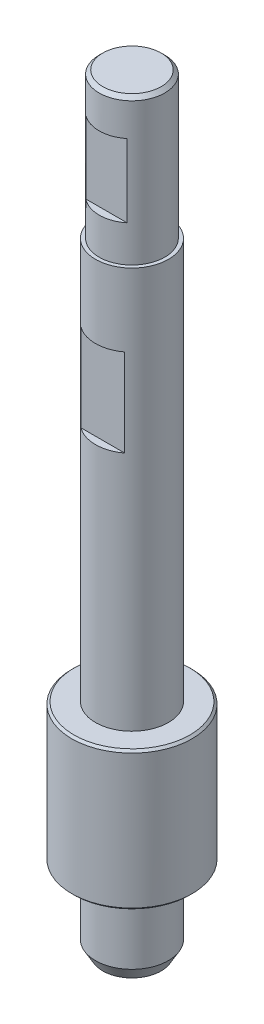
ISO-10303-21;
HEADER;
FILE_DESCRIPTION(('STEP AP214'),'2;1');
FILE_NAME('part.step','',(''),(''),'','','');
FILE_SCHEMA(('AUTOMOTIVE_DESIGN { 1 0 10303 214 1 1 1 1 }'));
ENDSEC;
DATA;
#1=APPLICATION_CONTEXT('core data for automotive mechanical design processes');
#2=APPLICATION_PROTOCOL_DEFINITION('international standard','automotive_design',2000,#1);
#3=PRODUCT_CONTEXT('',#1,'mechanical');
#4=PRODUCT('Part','Part','',(#3));
#5=PRODUCT_RELATED_PRODUCT_CATEGORY('part','',(#4));
#6=PRODUCT_DEFINITION_FORMATION('','',#4);
#7=PRODUCT_DEFINITION_CONTEXT('part definition',#1,'design');
#8=PRODUCT_DEFINITION('design','',#6,#7);
#9=PRODUCT_DEFINITION_SHAPE('','',#8);
#10=(LENGTH_UNIT() NAMED_UNIT(*) SI_UNIT(.MILLI.,.METRE.));
#11=(NAMED_UNIT(*) PLANE_ANGLE_UNIT() SI_UNIT($,.RADIAN.));
#12=(NAMED_UNIT(*) SI_UNIT($,.STERADIAN.) SOLID_ANGLE_UNIT());
#13=UNCERTAINTY_MEASURE_WITH_UNIT(LENGTH_MEASURE(1.E-05),#10,'distance_accuracy_value','');
#14=(GEOMETRIC_REPRESENTATION_CONTEXT(3) GLOBAL_UNCERTAINTY_ASSIGNED_CONTEXT((#13)) GLOBAL_UNIT_ASSIGNED_CONTEXT((#10,
#11,#12)) REPRESENTATION_CONTEXT('',''));
#15=CARTESIAN_POINT('',(0.,0.,0.));
#16=DIRECTION('',(0.,0.,1.));
#17=DIRECTION('',(1.,0.,0.));
#18=AXIS2_PLACEMENT_3D('',#15,#16,#17);
#19=CARTESIAN_POINT('',(0.,53.5571124821439,0.));
#20=DIRECTION('',(0.,1.,0.));
#21=DIRECTION('',(-1.,0.,0.));
#22=AXIS2_PLACEMENT_3D('',#19,#20,#21);
#23=CYLINDRICAL_SURFACE('',#22,4.5);
#24=CARTESIAN_POINT('',(0.,73.057112482144,0.));
#25=DIRECTION('',(0.,-1.,0.));
#26=DIRECTION('',(1.,0.,0.));
#27=AXIS2_PLACEMENT_3D('',#24,#25,#26);
#28=CIRCLE('',#27,4.5);
#29=CARTESIAN_POINT('',(4.49999999999998,73.057112482144,0.));
#30=VERTEX_POINT('',#29);
#31=EDGE_CURVE('E98',#30,#30,#28,.T.);
#32=ORIENTED_EDGE('',*,*,#31,.T.);
#33=EDGE_LOOP('',(#32));
#34=FACE_BOUND('',#33,.T.);
#35=CARTESIAN_POINT('',(0.,53.5571124821439,0.));
#36=DIRECTION('',(0.,1.,0.));
#37=DIRECTION('',(-1.,0.,0.));
#38=AXIS2_PLACEMENT_3D('',#35,#36,#37);
#39=CIRCLE('',#38,4.5);
#40=CARTESIAN_POINT('',(-4.50000000000002,53.5571124821439,0.));
#41=VERTEX_POINT('',#40);
#42=EDGE_CURVE('E88',#41,#41,#39,.T.);
#43=ORIENTED_EDGE('',*,*,#42,.T.);
#44=EDGE_LOOP('',(#43));
#45=FACE_BOUND('',#44,.T.);
#46=CARTESIAN_POINT('',(0.,68.557112482144,0.));
#47=DIRECTION('',(0.,1.,0.));
#48=DIRECTION('',(0.,0.,1.));
#49=AXIS2_PLACEMENT_3D('',#46,#47,#48);
#50=CIRCLE('',#49,4.5);
#51=CARTESIAN_POINT('',(2.82842712474617,68.557112482144,3.5));
#52=VERTEX_POINT('',#51);
#53=CARTESIAN_POINT('',(-2.82842712474621,68.557112482144,3.5));
#54=VERTEX_POINT('',#53);
#55=EDGE_CURVE('E82',#52,#54,#50,.F.);
#56=ORIENTED_EDGE('',*,*,#55,.F.);
#57=DIRECTION('',(0.,1.,0.));
#58=VECTOR('',#57,1.);
#59=CARTESIAN_POINT('',(2.82842712474617,53.5571124821439,3.5));
#60=LINE('',#59,#58);
#61=CARTESIAN_POINT('',(2.82842712474617,58.557112482144,3.5));
#62=VERTEX_POINT('',#61);
#63=EDGE_CURVE('E90',#52,#62,#60,.F.);
#64=ORIENTED_EDGE('',*,*,#63,.T.);
#65=CARTESIAN_POINT('',(0.,58.557112482144,0.));
#66=DIRECTION('',(0.,-1.,0.));
#67=DIRECTION('',(0.,0.,-1.));
#68=AXIS2_PLACEMENT_3D('',#65,#66,#67);
#69=CIRCLE('',#68,4.5);
#70=CARTESIAN_POINT('',(-2.82842712474621,58.557112482144,3.5));
#71=VERTEX_POINT('',#70);
#72=EDGE_CURVE('E87',#71,#62,#69,.F.);
#73=ORIENTED_EDGE('',*,*,#72,.F.);
#74=DIRECTION('',(0.,1.,0.));
#75=VECTOR('',#74,1.);
#76=CARTESIAN_POINT('',(-2.82842712474621,53.5571124821439,3.5));
#77=LINE('',#76,#75);
#78=EDGE_CURVE('E74',#71,#54,#77,.T.);
#79=ORIENTED_EDGE('',*,*,#78,.T.);
#80=EDGE_LOOP('',(#56,#64,#73,#79));
#81=FACE_BOUND('',#80,.T.);
#82=ADVANCED_FACE('F33',(#34,#45,#81),#23,.T.);
#83=CARTESIAN_POINT('',(0.,73.557112482144,0.));
#84=DIRECTION('',(0.,1.,0.));
#85=DIRECTION('',(-1.,0.,0.));
#86=AXIS2_PLACEMENT_3D('',#83,#84,#85);
#87=CYLINDRICAL_SURFACE('',#86,5.00000000000001);
#88=DIRECTION('',(0.,1.,0.));
#89=VECTOR('',#88,1.);
#90=CARTESIAN_POINT('',(2.99999999999999,73.557112482144,4.));
#91=LINE('',#90,#89);
#92=CARTESIAN_POINT('',(3.,31.5571124821439,4.));
#93=VERTEX_POINT('',#92);
#94=CARTESIAN_POINT('',(3.,43.5571124821439,4.));
#95=VERTEX_POINT('',#94);
#96=EDGE_CURVE('E83',#93,#95,#91,.T.);
#97=ORIENTED_EDGE('',*,*,#96,.F.);
#98=CARTESIAN_POINT('',(0.,31.5571124821439,0.));
#99=DIRECTION('',(0.,-1.,0.));
#100=DIRECTION('',(0.,0.,-1.));
#101=AXIS2_PLACEMENT_3D('',#98,#99,#100);
#102=CIRCLE('',#101,5.00000000000001);
#103=CARTESIAN_POINT('',(-3.00000000000002,31.5571124821439,4.));
#104=VERTEX_POINT('',#103);
#105=EDGE_CURVE('E144',#93,#104,#102,.T.);
#106=ORIENTED_EDGE('',*,*,#105,.T.);
#107=DIRECTION('',(0.,1.,0.));
#108=VECTOR('',#107,1.);
#109=CARTESIAN_POINT('',(-3.00000000000003,73.557112482144,4.));
#110=LINE('',#109,#108);
#111=CARTESIAN_POINT('',(-3.00000000000003,43.5571124821439,4.));
#112=VERTEX_POINT('',#111);
#113=EDGE_CURVE('E147',#112,#104,#110,.F.);
#114=ORIENTED_EDGE('',*,*,#113,.F.);
#115=CARTESIAN_POINT('',(0.,43.5571124821439,0.));
#116=DIRECTION('',(0.,1.,0.));
#117=DIRECTION('',(0.,0.,1.));
#118=AXIS2_PLACEMENT_3D('',#115,#116,#117);
#119=CIRCLE('',#118,5.00000000000001);
#120=EDGE_CURVE('E142',#112,#95,#119,.T.);
#121=ORIENTED_EDGE('',*,*,#120,.T.);
#122=EDGE_LOOP('',(#97,#106,#114,#121));
#123=FACE_BOUND('',#122,.T.);
#124=CARTESIAN_POINT('',(0.,-1.44288751785604,0.));
#125=DIRECTION('',(0.,1.,0.));
#126=DIRECTION('',(-1.,0.,0.));
#127=AXIS2_PLACEMENT_3D('',#124,#125,#126);
#128=CIRCLE('',#127,5.00000000000001);
#129=CARTESIAN_POINT('',(-5.00000000000002,-1.44288751785604,0.));
#130=VERTEX_POINT('',#129);
#131=EDGE_CURVE('E125',#130,#130,#128,.T.);
#132=ORIENTED_EDGE('',*,*,#131,.T.);
#133=EDGE_LOOP('',(#132));
#134=FACE_BOUND('',#133,.T.);
#135=CARTESIAN_POINT('',(0.,53.5571124821439,0.));
#136=DIRECTION('',(0.,1.,0.));
#137=DIRECTION('',(-1.,0.,0.));
#138=AXIS2_PLACEMENT_3D('',#135,#136,#137);
#139=CIRCLE('',#138,5.00000000000001);
#140=CARTESIAN_POINT('',(-5.00000000000002,53.5571124821439,0.));
#141=VERTEX_POINT('',#140);
#142=EDGE_CURVE('E150',#141,#141,#139,.T.);
#143=ORIENTED_EDGE('',*,*,#142,.F.);
#144=EDGE_LOOP('',(#143));
#145=FACE_BOUND('',#144,.T.);
#146=ADVANCED_FACE('F175',(#123,#134,#145),#87,.T.);
#147=CARTESIAN_POINT('',(5.00000000000001,-31.442887517856,0.));
#148=DIRECTION('',(0.,1.,0.));
#149=DIRECTION('',(-1.,0.,0.));
#150=AXIS2_PLACEMENT_3D('',#147,#148,#149);
#151=PLANE('',#150);
#152=CARTESIAN_POINT('',(0.,-31.442887517856,0.));
#153=DIRECTION('',(0.,1.,0.));
#154=DIRECTION('',(-1.,0.,0.));
#155=AXIS2_PLACEMENT_3D('',#152,#153,#154);
#156=CIRCLE('',#155,3.99999999999997);
#157=CARTESIAN_POINT('',(-3.99999999999997,-31.442887517856,0.));
#158=VERTEX_POINT('',#157);
#159=EDGE_CURVE('E139',#158,#158,#156,.F.);
#160=ORIENTED_EDGE('',*,*,#159,.T.);
#161=EDGE_LOOP('',(#160));
#162=FACE_BOUND('',#161,.T.);
#163=ADVANCED_FACE('F180',(#162),#151,.F.);
#164=CARTESIAN_POINT('',(0.,73.557112482144,0.));
#165=DIRECTION('',(0.,1.,0.));
#166=DIRECTION('',(-1.,0.,0.));
#167=AXIS2_PLACEMENT_3D('',#164,#165,#166);
#168=CYLINDRICAL_SURFACE('',#167,5.00000000000001);
#169=CARTESIAN_POINT('',(0.,-29.7108367102871,0.));
#170=DIRECTION('',(0.,1.,0.));
#171=DIRECTION('',(-1.,0.,0.));
#172=AXIS2_PLACEMENT_3D('',#169,#170,#171);
#173=CIRCLE('',#172,5.00000000000001);
#174=CARTESIAN_POINT('',(-5.00000000000001,-29.7108367102871,0.));
#175=VERTEX_POINT('',#174);
#176=EDGE_CURVE('E131',#175,#175,#173,.T.);
#177=ORIENTED_EDGE('',*,*,#176,.T.);
#178=EDGE_LOOP('',(#177));
#179=FACE_BOUND('',#178,.T.);
#180=CARTESIAN_POINT('',(0.,-20.442887517856,0.));
#181=DIRECTION('',(0.,1.,0.));
#182=DIRECTION('',(-1.,0.,0.));
#183=AXIS2_PLACEMENT_3D('',#180,#181,#182);
#184=CIRCLE('',#183,5.00000000000001);
#185=CARTESIAN_POINT('',(-5.00000000000001,-20.442887517856,0.));
#186=VERTEX_POINT('',#185);
#187=EDGE_CURVE('E127',#186,#186,#184,.T.);
#188=ORIENTED_EDGE('',*,*,#187,.F.);
#189=EDGE_LOOP('',(#188));
#190=FACE_BOUND('',#189,.T.);
#191=ADVANCED_FACE('F207',(#179,#190),#168,.T.);
#192=CARTESIAN_POINT('',(8.25000000000001,-20.442887517856,0.));
#193=DIRECTION('',(0.,1.,0.));
#194=DIRECTION('',(-1.,0.,0.));
#195=AXIS2_PLACEMENT_3D('',#192,#193,#194);
#196=PLANE('',#195);
#197=CARTESIAN_POINT('',(0.,-20.442887517856,0.));
#198=DIRECTION('',(0.,1.,0.));
#199=DIRECTION('',(-1.,0.,0.));
#200=AXIS2_PLACEMENT_3D('',#197,#198,#199);
#201=CIRCLE('',#200,7.95000000000003);
#202=CARTESIAN_POINT('',(-7.95000000000003,-20.442887517856,0.));
#203=VERTEX_POINT('',#202);
#204=EDGE_CURVE('E12',#203,#203,#201,.F.);
#205=ORIENTED_EDGE('',*,*,#204,.T.);
#206=EDGE_LOOP('',(#205));
#207=FACE_BOUND('',#206,.T.);
#208=ORIENTED_EDGE('',*,*,#187,.T.);
#209=EDGE_LOOP('',(#208));
#210=FACE_BOUND('',#209,.T.);
#211=ADVANCED_FACE('F211',(#207,#210),#196,.F.);
#212=CARTESIAN_POINT('',(0.,73.557112482144,0.));
#213=DIRECTION('',(0.,1.,0.));
#214=DIRECTION('',(-1.,0.,0.));
#215=AXIS2_PLACEMENT_3D('',#212,#213,#214);
#216=CYLINDRICAL_SURFACE('',#215,8.25000000000001);
#217=CARTESIAN_POINT('',(0.,-1.74288751785602,0.));
#218=DIRECTION('',(0.,-1.,0.));
#219=DIRECTION('',(1.,0.,0.));
#220=AXIS2_PLACEMENT_3D('',#217,#218,#219);
#221=CIRCLE('',#220,8.25000000000001);
#222=CARTESIAN_POINT('',(8.25000000000001,-1.74288751785602,0.));
#223=VERTEX_POINT('',#222);
#224=EDGE_CURVE('E41',#223,#223,#221,.T.);
#225=ORIENTED_EDGE('',*,*,#224,.T.);
#226=EDGE_LOOP('',(#225));
#227=FACE_BOUND('',#226,.T.);
#228=CARTESIAN_POINT('',(0.,-20.142887517856,0.));
#229=DIRECTION('',(0.,1.,0.));
#230=DIRECTION('',(-1.,0.,0.));
#231=AXIS2_PLACEMENT_3D('',#228,#229,#230);
#232=CIRCLE('',#231,8.25000000000001);
#233=CARTESIAN_POINT('',(-8.25000000000001,-20.1428875178561,0.));
#234=VERTEX_POINT('',#233);
#235=EDGE_CURVE('E104',#234,#234,#232,.T.);
#236=ORIENTED_EDGE('',*,*,#235,.T.);
#237=EDGE_LOOP('',(#236));
#238=FACE_BOUND('',#237,.T.);
#239=ADVANCED_FACE('F109',(#227,#238),#216,.T.);
#240=CARTESIAN_POINT('',(5.00000000000001,-1.44288751785604,0.));
#241=DIRECTION('',(0.,-1.,0.));
#242=DIRECTION('',(1.,0.,0.));
#243=AXIS2_PLACEMENT_3D('',#240,#241,#242);
#244=PLANE('',#243);
#245=CARTESIAN_POINT('',(0.,-1.44288751785604,0.));
#246=DIRECTION('',(0.,-1.,0.));
#247=DIRECTION('',(1.,0.,0.));
#248=AXIS2_PLACEMENT_3D('',#245,#246,#247);
#249=CIRCLE('',#248,7.95000000000003);
#250=CARTESIAN_POINT('',(7.95000000000002,-1.44288751785604,0.));
#251=VERTEX_POINT('',#250);
#252=EDGE_CURVE('E101',#251,#251,#249,.F.);
#253=ORIENTED_EDGE('',*,*,#252,.T.);
#254=EDGE_LOOP('',(#253));
#255=FACE_BOUND('',#254,.T.);
#256=ORIENTED_EDGE('',*,*,#131,.F.);
#257=EDGE_LOOP('',(#256));
#258=FACE_BOUND('',#257,.T.);
#259=ADVANCED_FACE('F118',(#255,#258),#244,.F.);
#260=CARTESIAN_POINT('',(0.,-29.7108367102871,0.));
#261=DIRECTION('',(0.,1.,0.));
#262=DIRECTION('',(-1.,0.,0.));
#263=AXIS2_PLACEMENT_3D('',#260,#261,#262);
#264=CONICAL_SURFACE('',#263,5.00000000000001,0.523598775598302);
#265=ORIENTED_EDGE('',*,*,#159,.F.);
#266=EDGE_LOOP('',(#265));
#267=FACE_BOUND('',#266,.T.);
#268=ORIENTED_EDGE('',*,*,#176,.F.);
#269=EDGE_LOOP('',(#268));
#270=FACE_BOUND('',#269,.T.);
#271=ADVANCED_FACE('F121',(#267,#270),#264,.T.);
#272=CARTESIAN_POINT('',(-24.2664786615104,31.5571124821439,4.));
#273=DIRECTION('',(0.,-1.,0.));
#274=DIRECTION('',(0.,0.,-1.));
#275=AXIS2_PLACEMENT_3D('',#272,#273,#274);
#276=PLANE('',#275);
#277=DIRECTION('',(1.,0.,0.));
#278=VECTOR('',#277,1.);
#279=CARTESIAN_POINT('',(-24.2664786615104,31.5571124821439,4.));
#280=LINE('',#279,#278);
#281=EDGE_CURVE('E128',#104,#93,#280,.T.);
#282=ORIENTED_EDGE('',*,*,#281,.F.);
#283=ORIENTED_EDGE('',*,*,#105,.F.);
#284=EDGE_LOOP('',(#282,#283));
#285=FACE_BOUND('',#284,.T.);
#286=ADVANCED_FACE('F202',(#285),#276,.F.);
#287=CARTESIAN_POINT('',(-24.2664786615104,43.5571124821439,4.));
#288=DIRECTION('',(0.,1.,0.));
#289=DIRECTION('',(0.,0.,1.));
#290=AXIS2_PLACEMENT_3D('',#287,#288,#289);
#291=PLANE('',#290);
#292=ORIENTED_EDGE('',*,*,#120,.F.);
#293=DIRECTION('',(-1.,0.,0.));
#294=VECTOR('',#293,1.);
#295=CARTESIAN_POINT('',(-24.2664786615104,43.5571124821439,4.));
#296=LINE('',#295,#294);
#297=EDGE_CURVE('E56',#95,#112,#296,.T.);
#298=ORIENTED_EDGE('',*,*,#297,.F.);
#299=EDGE_LOOP('',(#292,#298));
#300=FACE_BOUND('',#299,.T.);
#301=ADVANCED_FACE('F171',(#300),#291,.F.);
#302=CARTESIAN_POINT('',(24.2664786615104,31.5571124821439,4.));
#303=DIRECTION('',(0.,0.,1.));
#304=DIRECTION('',(1.,0.,0.));
#305=AXIS2_PLACEMENT_3D('',#302,#303,#304);
#306=PLANE('',#305);
#307=ORIENTED_EDGE('',*,*,#96,.T.);
#308=ORIENTED_EDGE('',*,*,#297,.T.);
#309=ORIENTED_EDGE('',*,*,#113,.T.);
#310=ORIENTED_EDGE('',*,*,#281,.T.);
#311=EDGE_LOOP('',(#307,#308,#309,#310));
#312=FACE_BOUND('',#311,.T.);
#313=ADVANCED_FACE('F163',(#312),#306,.T.);
#314=CARTESIAN_POINT('',(0.,53.5571124821439,0.));
#315=DIRECTION('',(0.,1.,0.));
#316=DIRECTION('',(-1.,0.,0.));
#317=AXIS2_PLACEMENT_3D('',#314,#315,#316);
#318=PLANE('',#317);
#319=ORIENTED_EDGE('',*,*,#42,.F.);
#320=EDGE_LOOP('',(#319));
#321=FACE_BOUND('',#320,.T.);
#322=ORIENTED_EDGE('',*,*,#142,.T.);
#323=EDGE_LOOP('',(#322));
#324=FACE_BOUND('',#323,.T.);
#325=ADVANCED_FACE('F160',(#321,#324),#318,.T.);
#326=CARTESIAN_POINT('',(4.99999999999998,73.557112482144,0.));
#327=DIRECTION('',(0.,-1.,0.));
#328=DIRECTION('',(1.,0.,0.));
#329=AXIS2_PLACEMENT_3D('',#326,#327,#328);
#330=PLANE('',#329);
#331=CARTESIAN_POINT('',(0.,73.557112482144,0.));
#332=DIRECTION('',(0.,-1.,0.));
#333=DIRECTION('',(1.,0.,0.));
#334=AXIS2_PLACEMENT_3D('',#331,#332,#333);
#335=CIRCLE('',#334,4.);
#336=CARTESIAN_POINT('',(3.99999999999998,73.557112482144,0.));
#337=VERTEX_POINT('',#336);
#338=EDGE_CURVE('E92',#337,#337,#335,.F.);
#339=ORIENTED_EDGE('',*,*,#338,.T.);
#340=EDGE_LOOP('',(#339));
#341=FACE_BOUND('',#340,.T.);
#342=ADVANCED_FACE('F162',(#341),#330,.F.);
#343=CARTESIAN_POINT('',(-18.6830410933752,58.557112482144,3.5));
#344=DIRECTION('',(0.,-1.,0.));
#345=DIRECTION('',(0.,0.,-1.));
#346=AXIS2_PLACEMENT_3D('',#343,#344,#345);
#347=PLANE('',#346);
#348=ORIENTED_EDGE('',*,*,#72,.T.);
#349=DIRECTION('',(1.,0.,0.));
#350=VECTOR('',#349,1.);
#351=CARTESIAN_POINT('',(-18.6830410933752,58.557112482144,3.5));
#352=LINE('',#351,#350);
#353=EDGE_CURVE('E77',#71,#62,#352,.T.);
#354=ORIENTED_EDGE('',*,*,#353,.F.);
#355=EDGE_LOOP('',(#348,#354));
#356=FACE_BOUND('',#355,.T.);
#357=ADVANCED_FACE('F86',(#356),#347,.F.);
#358=CARTESIAN_POINT('',(-18.6830410933752,68.557112482144,3.5));
#359=DIRECTION('',(0.,1.,0.));
#360=DIRECTION('',(0.,0.,1.));
#361=AXIS2_PLACEMENT_3D('',#358,#359,#360);
#362=PLANE('',#361);
#363=ORIENTED_EDGE('',*,*,#55,.T.);
#364=DIRECTION('',(-1.,0.,0.));
#365=VECTOR('',#364,1.);
#366=CARTESIAN_POINT('',(-18.6830410933752,68.557112482144,3.5));
#367=LINE('',#366,#365);
#368=EDGE_CURVE('E48',#52,#54,#367,.T.);
#369=ORIENTED_EDGE('',*,*,#368,.F.);
#370=EDGE_LOOP('',(#363,#369));
#371=FACE_BOUND('',#370,.T.);
#372=ADVANCED_FACE('F184',(#371),#362,.F.);
#373=CARTESIAN_POINT('',(18.6830410933753,58.557112482144,3.5));
#374=DIRECTION('',(0.,0.,1.));
#375=DIRECTION('',(1.,0.,0.));
#376=AXIS2_PLACEMENT_3D('',#373,#374,#375);
#377=PLANE('',#376);
#378=ORIENTED_EDGE('',*,*,#368,.T.);
#379=ORIENTED_EDGE('',*,*,#78,.F.);
#380=ORIENTED_EDGE('',*,*,#353,.T.);
#381=ORIENTED_EDGE('',*,*,#63,.F.);
#382=EDGE_LOOP('',(#378,#379,#380,#381));
#383=FACE_BOUND('',#382,.T.);
#384=ADVANCED_FACE('F76',(#383),#377,.T.);
#385=CARTESIAN_POINT('',(0.,73.557112482144,0.));
#386=DIRECTION('',(0.,-1.,0.));
#387=DIRECTION('',(1.,0.,0.));
#388=AXIS2_PLACEMENT_3D('',#385,#386,#387);
#389=CONICAL_SURFACE('',#388,4.,0.785398163397445);
#390=ORIENTED_EDGE('',*,*,#31,.F.);
#391=EDGE_LOOP('',(#390));
#392=FACE_BOUND('',#391,.T.);
#393=ORIENTED_EDGE('',*,*,#338,.F.);
#394=EDGE_LOOP('',(#393));
#395=FACE_BOUND('',#394,.T.);
#396=ADVANCED_FACE('F115',(#392,#395),#389,.T.);
#397=CARTESIAN_POINT('',(0.,-1.44288751785604,0.));
#398=DIRECTION('',(0.,-1.,0.));
#399=DIRECTION('',(1.,0.,0.));
#400=AXIS2_PLACEMENT_3D('',#397,#398,#399);
#401=CONICAL_SURFACE('',#400,7.95000000000003,0.78539816339746);
#402=ORIENTED_EDGE('',*,*,#224,.F.);
#403=EDGE_LOOP('',(#402));
#404=FACE_BOUND('',#403,.T.);
#405=ORIENTED_EDGE('',*,*,#252,.F.);
#406=EDGE_LOOP('',(#405));
#407=FACE_BOUND('',#406,.T.);
#408=ADVANCED_FACE('F112',(#404,#407),#401,.T.);
#409=CARTESIAN_POINT('',(0.,-20.142887517856,0.));
#410=DIRECTION('',(0.,1.,0.));
#411=DIRECTION('',(-1.,0.,0.));
#412=AXIS2_PLACEMENT_3D('',#409,#410,#411);
#413=CONICAL_SURFACE('',#412,8.25000000000001,0.78539816339744);
#414=ORIENTED_EDGE('',*,*,#204,.F.);
#415=EDGE_LOOP('',(#414));
#416=FACE_BOUND('',#415,.T.);
#417=ORIENTED_EDGE('',*,*,#235,.F.);
#418=EDGE_LOOP('',(#417));
#419=FACE_BOUND('',#418,.T.);
#420=ADVANCED_FACE('F35',(#416,#419),#413,.T.);
#421=CLOSED_SHELL('',(#82,#146,#163,#191,#211,#239,#259,#271,#286,#301,#313,#325,#342,#357,#372,
#384,#396,#408,#420));
#422=MANIFOLD_SOLID_BREP('B2',#421);
#423=ADVANCED_BREP_SHAPE_REPRESENTATION('',(#18,#422),#14);
#424=SHAPE_DEFINITION_REPRESENTATION(#9,#423);
ENDSEC;
END-ISO-10303-21;
